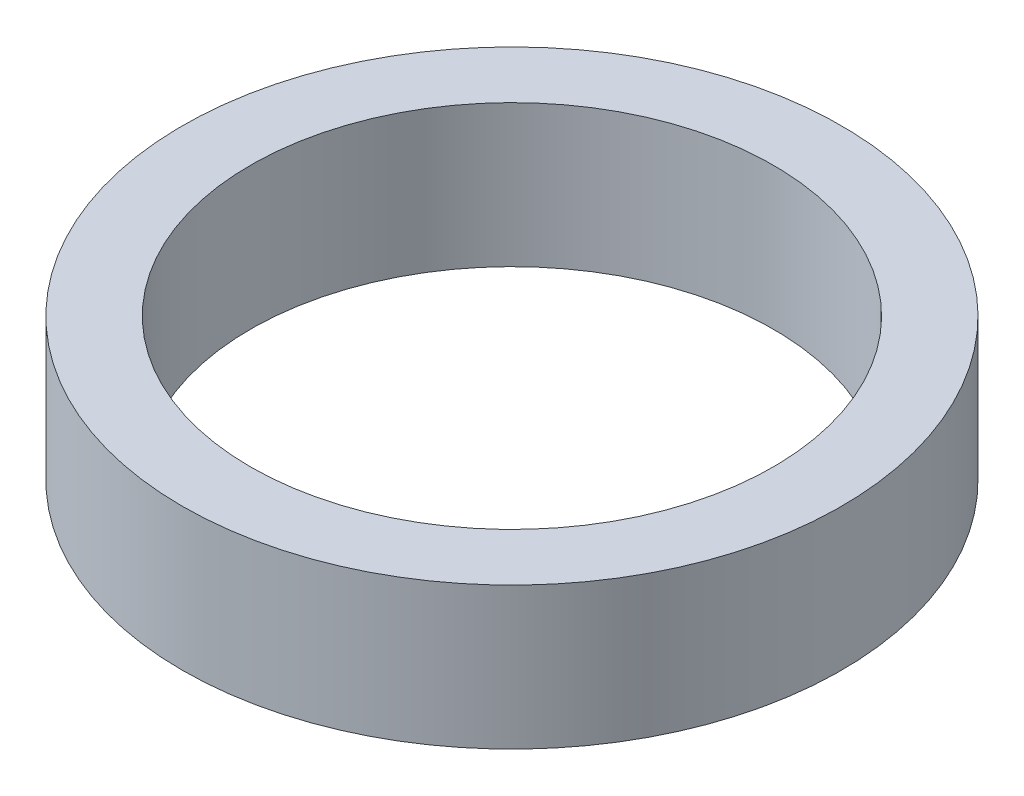
ISO-10303-21;
HEADER;
FILE_DESCRIPTION(('STEP AP214'),'2;1');
FILE_NAME('part.step','',(''),(''),'','','');
FILE_SCHEMA(('AUTOMOTIVE_DESIGN { 1 0 10303 214 1 1 1 1 }'));
ENDSEC;
DATA;
#1=APPLICATION_CONTEXT('core data for automotive mechanical design processes');
#2=APPLICATION_PROTOCOL_DEFINITION('international standard','automotive_design',2000,#1);
#3=PRODUCT_CONTEXT('',#1,'mechanical');
#4=PRODUCT('Part','Part','',(#3));
#5=PRODUCT_RELATED_PRODUCT_CATEGORY('part','',(#4));
#6=PRODUCT_DEFINITION_FORMATION('','',#4);
#7=PRODUCT_DEFINITION_CONTEXT('part definition',#1,'design');
#8=PRODUCT_DEFINITION('design','',#6,#7);
#9=PRODUCT_DEFINITION_SHAPE('','',#8);
#10=(LENGTH_UNIT() NAMED_UNIT(*) SI_UNIT(.MILLI.,.METRE.));
#11=(NAMED_UNIT(*) PLANE_ANGLE_UNIT() SI_UNIT($,.RADIAN.));
#12=(NAMED_UNIT(*) SI_UNIT($,.STERADIAN.) SOLID_ANGLE_UNIT());
#13=UNCERTAINTY_MEASURE_WITH_UNIT(LENGTH_MEASURE(1.E-05),#10,'distance_accuracy_value','');
#14=(GEOMETRIC_REPRESENTATION_CONTEXT(3) GLOBAL_UNCERTAINTY_ASSIGNED_CONTEXT((#13)) GLOBAL_UNIT_ASSIGNED_CONTEXT((#10,
#11,#12)) REPRESENTATION_CONTEXT('',''));
#15=CARTESIAN_POINT('',(0.,0.,0.));
#16=DIRECTION('',(0.,0.,1.));
#17=DIRECTION('',(1.,0.,0.));
#18=AXIS2_PLACEMENT_3D('',#15,#16,#17);
#19=CARTESIAN_POINT('',(0.,125.,0.));
#20=DIRECTION('',(0.,-1.,0.));
#21=DIRECTION('',(0.,0.,-1.));
#22=AXIS2_PLACEMENT_3D('',#19,#20,#21);
#23=CYLINDRICAL_SURFACE('',#22,290.);
#24=CARTESIAN_POINT('',(0.,125.,0.));
#25=DIRECTION('',(0.,1.,0.));
#26=DIRECTION('',(0.,0.,1.));
#27=AXIS2_PLACEMENT_3D('',#24,#25,#26);
#28=CIRCLE('',#27,290.);
#29=CARTESIAN_POINT('',(0.,125.,290.));
#30=VERTEX_POINT('',#29);
#31=EDGE_CURVE('E10',#30,#30,#28,.T.);
#32=ORIENTED_EDGE('',*,*,#31,.F.);
#33=EDGE_LOOP('',(#32));
#34=FACE_BOUND('',#33,.T.);
#35=CARTESIAN_POINT('',(0.,0.,0.));
#36=DIRECTION('',(0.,1.,0.));
#37=DIRECTION('',(0.,0.,1.));
#38=AXIS2_PLACEMENT_3D('',#35,#36,#37);
#39=CIRCLE('',#38,290.);
#40=CARTESIAN_POINT('',(0.,0.,290.));
#41=VERTEX_POINT('',#40);
#42=EDGE_CURVE('E39',#41,#41,#39,.T.);
#43=ORIENTED_EDGE('',*,*,#42,.T.);
#44=EDGE_LOOP('',(#43));
#45=FACE_BOUND('',#44,.T.);
#46=ADVANCED_FACE('F36',(#34,#45),#23,.T.);
#47=CARTESIAN_POINT('',(0.,125.,0.));
#48=DIRECTION('',(0.,1.,0.));
#49=DIRECTION('',(0.,0.,1.));
#50=AXIS2_PLACEMENT_3D('',#47,#48,#49);
#51=PLANE('',#50);
#52=CARTESIAN_POINT('',(0.,125.,0.));
#53=DIRECTION('',(0.,1.,0.));
#54=DIRECTION('',(0.,0.,1.));
#55=AXIS2_PLACEMENT_3D('',#52,#53,#54);
#56=CIRCLE('',#55,230.);
#57=CARTESIAN_POINT('',(0.,125.,230.));
#58=VERTEX_POINT('',#57);
#59=EDGE_CURVE('E48',#58,#58,#56,.T.);
#60=ORIENTED_EDGE('',*,*,#59,.F.);
#61=EDGE_LOOP('',(#60));
#62=FACE_BOUND('',#61,.T.);
#63=ORIENTED_EDGE('',*,*,#31,.T.);
#64=EDGE_LOOP('',(#63));
#65=FACE_BOUND('',#64,.T.);
#66=ADVANCED_FACE('F63',(#62,#65),#51,.T.);
#67=CARTESIAN_POINT('',(0.,0.,0.));
#68=DIRECTION('',(0.,1.,0.));
#69=DIRECTION('',(0.,0.,1.));
#70=AXIS2_PLACEMENT_3D('',#67,#68,#69);
#71=PLANE('',#70);
#72=CARTESIAN_POINT('',(0.,0.,0.));
#73=DIRECTION('',(0.,1.,0.));
#74=DIRECTION('',(0.,0.,1.));
#75=AXIS2_PLACEMENT_3D('',#72,#73,#74);
#76=CIRCLE('',#75,230.);
#77=CARTESIAN_POINT('',(0.,0.,230.));
#78=VERTEX_POINT('',#77);
#79=EDGE_CURVE('E46',#78,#78,#76,.T.);
#80=ORIENTED_EDGE('',*,*,#79,.T.);
#81=EDGE_LOOP('',(#80));
#82=FACE_BOUND('',#81,.T.);
#83=ORIENTED_EDGE('',*,*,#42,.F.);
#84=EDGE_LOOP('',(#83));
#85=FACE_BOUND('',#84,.T.);
#86=ADVANCED_FACE('F54',(#82,#85),#71,.F.);
#87=CARTESIAN_POINT('',(0.,0.,0.));
#88=DIRECTION('',(0.,1.,0.));
#89=DIRECTION('',(0.,0.,1.));
#90=AXIS2_PLACEMENT_3D('',#87,#88,#89);
#91=CYLINDRICAL_SURFACE('',#90,230.);
#92=ORIENTED_EDGE('',*,*,#79,.F.);
#93=EDGE_LOOP('',(#92));
#94=FACE_BOUND('',#93,.T.);
#95=ORIENTED_EDGE('',*,*,#59,.T.);
#96=EDGE_LOOP('',(#95));
#97=FACE_BOUND('',#96,.T.);
#98=ADVANCED_FACE('F57',(#94,#97),#91,.F.);
#99=CLOSED_SHELL('',(#46,#66,#86,#98));
#100=MANIFOLD_SOLID_BREP('B2',#99);
#101=ADVANCED_BREP_SHAPE_REPRESENTATION('',(#18,#100),#14);
#102=SHAPE_DEFINITION_REPRESENTATION(#9,#101);
ENDSEC;
END-ISO-10303-21;
